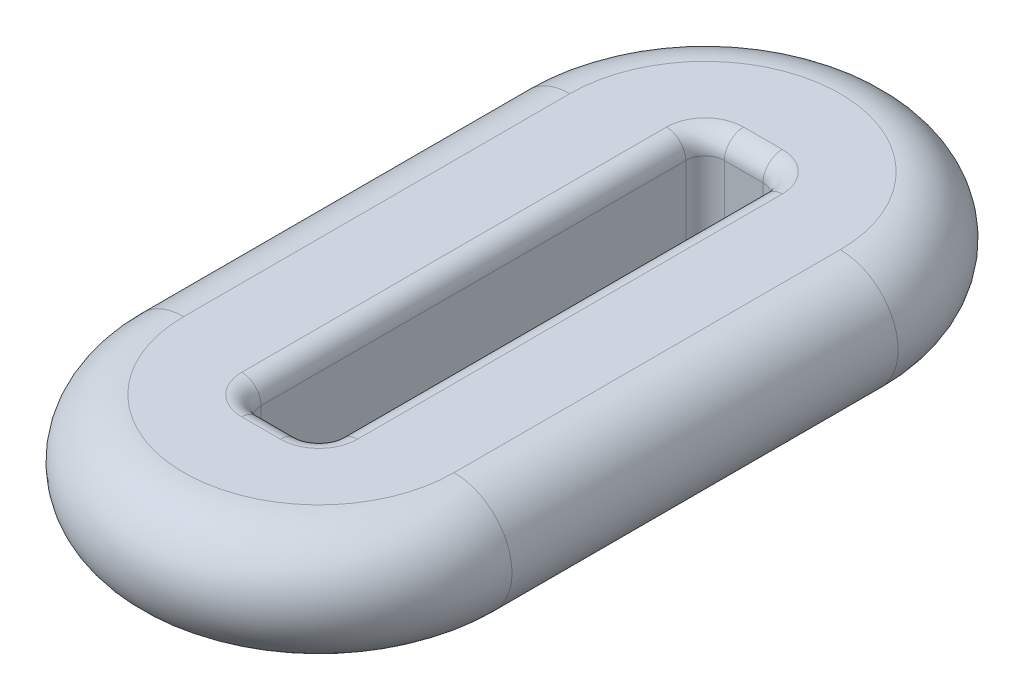
ISO-10303-21;
HEADER;
FILE_DESCRIPTION(('STEP AP214'),'2;1');
FILE_NAME('part.step','',(''),(''),'','','');
FILE_SCHEMA(('AUTOMOTIVE_DESIGN { 1 0 10303 214 1 1 1 1 }'));
ENDSEC;
DATA;
#1=APPLICATION_CONTEXT('core data for automotive mechanical design processes');
#2=APPLICATION_PROTOCOL_DEFINITION('international standard','automotive_design',2000,#1);
#3=PRODUCT_CONTEXT('',#1,'mechanical');
#4=PRODUCT('Part','Part','',(#3));
#5=PRODUCT_RELATED_PRODUCT_CATEGORY('part','',(#4));
#6=PRODUCT_DEFINITION_FORMATION('','',#4);
#7=PRODUCT_DEFINITION_CONTEXT('part definition',#1,'design');
#8=PRODUCT_DEFINITION('design','',#6,#7);
#9=PRODUCT_DEFINITION_SHAPE('','',#8);
#10=(LENGTH_UNIT() NAMED_UNIT(*) SI_UNIT(.MILLI.,.METRE.));
#11=(NAMED_UNIT(*) PLANE_ANGLE_UNIT() SI_UNIT($,.RADIAN.));
#12=(NAMED_UNIT(*) SI_UNIT($,.STERADIAN.) SOLID_ANGLE_UNIT());
#13=UNCERTAINTY_MEASURE_WITH_UNIT(LENGTH_MEASURE(1.E-05),#10,'distance_accuracy_value','');
#14=(GEOMETRIC_REPRESENTATION_CONTEXT(3) GLOBAL_UNCERTAINTY_ASSIGNED_CONTEXT((#13)) GLOBAL_UNIT_ASSIGNED_CONTEXT((#10,
#11,#12)) REPRESENTATION_CONTEXT('',''));
#15=CARTESIAN_POINT('',(0.,0.,0.));
#16=DIRECTION('',(0.,0.,1.));
#17=DIRECTION('',(1.,0.,0.));
#18=AXIS2_PLACEMENT_3D('',#15,#16,#17);
#19=CARTESIAN_POINT('',(0.,0.,5.));
#20=DIRECTION('',(0.,-1.,0.));
#21=DIRECTION('',(0.,0.,-0.999999999999999));
#22=AXIS2_PLACEMENT_3D('',#19,#20,#21);
#23=TOROIDAL_SURFACE('',#22,3.5,1.5);
#24=CARTESIAN_POINT('',(-3.49999999999998,0.,5.));
#25=DIRECTION('',(0.,0.,-0.999999999999999));
#26=DIRECTION('',(-1.,0.,0.));
#27=AXIS2_PLACEMENT_3D('',#24,#25,#26);
#28=CIRCLE('',#27,1.5);
#29=CARTESIAN_POINT('',(-3.50000000000003,-1.50000000000003,5.));
#30=VERTEX_POINT('',#29);
#31=CARTESIAN_POINT('',(-3.5,1.5,5.));
#32=VERTEX_POINT('',#31);
#33=EDGE_CURVE('E13',#30,#32,#28,.T.);
#34=ORIENTED_EDGE('',*,*,#33,.F.);
#35=CARTESIAN_POINT('',(0.,-1.5,5.));
#36=DIRECTION('',(0.,1.,0.));
#37=DIRECTION('',(0.,0.,0.999999999999999));
#38=AXIS2_PLACEMENT_3D('',#35,#36,#37);
#39=CIRCLE('',#38,3.5);
#40=CARTESIAN_POINT('',(3.5,-1.49999999999997,5.));
#41=VERTEX_POINT('',#40);
#42=EDGE_CURVE('E267',#41,#30,#39,.F.);
#43=ORIENTED_EDGE('',*,*,#42,.F.);
#44=CARTESIAN_POINT('',(3.5,0.,5.));
#45=DIRECTION('',(0.,0.,0.999999999999999));
#46=DIRECTION('',(1.,0.,0.));
#47=AXIS2_PLACEMENT_3D('',#44,#45,#46);
#48=CIRCLE('',#47,1.5);
#49=CARTESIAN_POINT('',(3.50000000000003,1.50000000000003,5.));
#50=VERTEX_POINT('',#49);
#51=EDGE_CURVE('E58',#41,#50,#48,.T.);
#52=ORIENTED_EDGE('',*,*,#51,.T.);
#53=CARTESIAN_POINT('',(0.,1.49999999999997,5.));
#54=DIRECTION('',(0.,1.,0.));
#55=DIRECTION('',(0.,0.,0.999999999999999));
#56=AXIS2_PLACEMENT_3D('',#53,#54,#55);
#57=CIRCLE('',#56,3.5);
#58=EDGE_CURVE('E319',#32,#50,#57,.T.);
#59=ORIENTED_EDGE('',*,*,#58,.F.);
#60=EDGE_LOOP('',(#34,#43,#52,#59));
#61=FACE_BOUND('',#60,.T.);
#62=ADVANCED_FACE('F51',(#61),#23,.T.);
#63=CARTESIAN_POINT('',(3.5,0.,-4.99999999999999));
#64=DIRECTION('',(0.,0.,0.999999999999999));
#65=DIRECTION('',(1.,0.,0.));
#66=AXIS2_PLACEMENT_3D('',#63,#64,#65);
#67=CYLINDRICAL_SURFACE('',#66,1.5);
#68=ORIENTED_EDGE('',*,*,#51,.F.);
#69=DIRECTION('',(0.,0.,0.999999999999999));
#70=VECTOR('',#69,1.);
#71=CARTESIAN_POINT('',(3.5,-1.49999999999997,9.99999999999998));
#72=LINE('',#71,#70);
#73=CARTESIAN_POINT('',(3.5,-1.49999999999997,-4.99999999999999));
#74=VERTEX_POINT('',#73);
#75=EDGE_CURVE('E310',#74,#41,#72,.T.);
#76=ORIENTED_EDGE('',*,*,#75,.F.);
#77=CARTESIAN_POINT('',(3.5,0.,-4.99999999999999));
#78=DIRECTION('',(0.,0.,0.999999999999999));
#79=DIRECTION('',(1.,0.,0.));
#80=AXIS2_PLACEMENT_3D('',#77,#78,#79);
#81=CIRCLE('',#80,1.5);
#82=CARTESIAN_POINT('',(3.50000000000006,1.50000000000003,-4.99999999999999));
#83=VERTEX_POINT('',#82);
#84=EDGE_CURVE('E73',#74,#83,#81,.T.);
#85=ORIENTED_EDGE('',*,*,#84,.T.);
#86=DIRECTION('',(0.,0.,-0.999999999999999));
#87=VECTOR('',#86,1.);
#88=CARTESIAN_POINT('',(3.50000000000006,1.50000000000003,-4.99999999999999));
#89=LINE('',#88,#87);
#90=EDGE_CURVE('E322',#50,#83,#89,.T.);
#91=ORIENTED_EDGE('',*,*,#90,.F.);
#92=EDGE_LOOP('',(#68,#76,#85,#91));
#93=FACE_BOUND('',#92,.T.);
#94=ADVANCED_FACE('F335',(#93),#67,.T.);
#95=CARTESIAN_POINT('',(0.,0.,-4.99999999999999));
#96=DIRECTION('',(0.,-1.,0.));
#97=DIRECTION('',(0.,0.,-0.999999999999999));
#98=AXIS2_PLACEMENT_3D('',#95,#96,#97);
#99=TOROIDAL_SURFACE('',#98,3.5,1.5);
#100=ORIENTED_EDGE('',*,*,#84,.F.);
#101=CARTESIAN_POINT('',(0.,-1.5,-4.99999999999999));
#102=DIRECTION('',(0.,1.,0.));
#103=DIRECTION('',(0.,0.,0.999999999999999));
#104=AXIS2_PLACEMENT_3D('',#101,#102,#103);
#105=CIRCLE('',#104,3.5);
#106=CARTESIAN_POINT('',(-3.50000000000003,-1.50000000000003,-5.));
#107=VERTEX_POINT('',#106);
#108=EDGE_CURVE('E313',#107,#74,#105,.F.);
#109=ORIENTED_EDGE('',*,*,#108,.F.);
#110=CARTESIAN_POINT('',(-3.49999999999998,0.,-4.99999999999999));
#111=DIRECTION('',(0.,0.,-0.999999999999999));
#112=DIRECTION('',(0.,1.,0.));
#113=AXIS2_PLACEMENT_3D('',#110,#111,#112);
#114=CIRCLE('',#113,1.5);
#115=CARTESIAN_POINT('',(-3.5,1.5,-5.));
#116=VERTEX_POINT('',#115);
#117=EDGE_CURVE('E65',#107,#116,#114,.T.);
#118=ORIENTED_EDGE('',*,*,#117,.T.);
#119=CARTESIAN_POINT('',(0.,1.49999999999997,-4.99999999999999));
#120=DIRECTION('',(0.,1.,0.));
#121=DIRECTION('',(0.,0.,0.999999999999999));
#122=AXIS2_PLACEMENT_3D('',#119,#120,#121);
#123=CIRCLE('',#122,3.5);
#124=EDGE_CURVE('E325',#83,#116,#123,.T.);
#125=ORIENTED_EDGE('',*,*,#124,.F.);
#126=EDGE_LOOP('',(#100,#109,#118,#125));
#127=FACE_BOUND('',#126,.T.);
#128=ADVANCED_FACE('F343',(#127),#99,.T.);
#129=CARTESIAN_POINT('',(-3.49999999999998,0.,5.));
#130=DIRECTION('',(0.,0.,-0.999999999999999));
#131=DIRECTION('',(-1.,0.,0.));
#132=AXIS2_PLACEMENT_3D('',#129,#130,#131);
#133=CYLINDRICAL_SURFACE('',#132,1.5);
#134=DIRECTION('',(0.,0.,-0.999999999999999));
#135=VECTOR('',#134,1.);
#136=CARTESIAN_POINT('',(-3.50000000000003,-1.50000000000003,9.99999999999998));
#137=LINE('',#136,#135);
#138=EDGE_CURVE('E316',#30,#107,#137,.T.);
#139=ORIENTED_EDGE('',*,*,#138,.F.);
#140=ORIENTED_EDGE('',*,*,#33,.T.);
#141=DIRECTION('',(0.,0.,0.999999999999999));
#142=VECTOR('',#141,1.);
#143=CARTESIAN_POINT('',(-3.5,1.5,5.));
#144=LINE('',#143,#142);
#145=EDGE_CURVE('E328',#116,#32,#144,.T.);
#146=ORIENTED_EDGE('',*,*,#145,.F.);
#147=ORIENTED_EDGE('',*,*,#117,.F.);
#148=EDGE_LOOP('',(#139,#140,#146,#147));
#149=FACE_BOUND('',#148,.T.);
#150=ADVANCED_FACE('F341',(#149),#133,.T.);
#151=CARTESIAN_POINT('',(-5.,1.49999999999997,9.99999999999998));
#152=DIRECTION('',(0.,1.,0.));
#153=DIRECTION('',(0.,0.,0.999999999999999));
#154=AXIS2_PLACEMENT_3D('',#151,#152,#153);
#155=PLANE('',#154);
#156=ORIENTED_EDGE('',*,*,#124,.T.);
#157=ORIENTED_EDGE('',*,*,#145,.T.);
#158=ORIENTED_EDGE('',*,*,#58,.T.);
#159=ORIENTED_EDGE('',*,*,#90,.T.);
#160=EDGE_LOOP('',(#156,#157,#158,#159));
#161=FACE_BOUND('',#160,.T.);
#162=DIRECTION('',(0.,0.,0.999999999999999));
#163=VECTOR('',#162,1.);
#164=CARTESIAN_POINT('',(-1.49999999999995,1.5,9.99999999999998));
#165=LINE('',#164,#163);
#166=CARTESIAN_POINT('',(-1.49999999999995,1.5,5.50000000000001));
#167=VERTEX_POINT('',#166);
#168=CARTESIAN_POINT('',(-1.49999999999995,1.5,-5.50000000000001));
#169=VERTEX_POINT('',#168);
#170=EDGE_CURVE('E247',#167,#169,#165,.F.);
#171=ORIENTED_EDGE('',*,*,#170,.T.);
#172=CARTESIAN_POINT('',(-0.499999999999945,1.49999999999997,-5.50000000000001));
#173=DIRECTION('',(0.,1.,0.));
#174=DIRECTION('',(0.,0.,0.999999999999999));
#175=AXIS2_PLACEMENT_3D('',#172,#173,#174);
#176=CIRCLE('',#175,1.);
#177=CARTESIAN_POINT('',(-0.499999999999945,1.49999999999997,-6.50000000000001));
#178=VERTEX_POINT('',#177);
#179=EDGE_CURVE('E261',#169,#178,#176,.F.);
#180=ORIENTED_EDGE('',*,*,#179,.T.);
#181=DIRECTION('',(-1.,0.,0.));
#182=VECTOR('',#181,1.);
#183=CARTESIAN_POINT('',(-5.,1.49999999999997,-6.50000000000001));
#184=LINE('',#183,#182);
#185=CARTESIAN_POINT('',(0.5,1.49999999999997,-6.50000000000001));
#186=VERTEX_POINT('',#185);
#187=EDGE_CURVE('E259',#178,#186,#184,.F.);
#188=ORIENTED_EDGE('',*,*,#187,.T.);
#189=CARTESIAN_POINT('',(0.5,1.49999999999997,-5.50000000000001));
#190=DIRECTION('',(0.,1.,0.));
#191=DIRECTION('',(0.,0.,0.999999999999999));
#192=AXIS2_PLACEMENT_3D('',#189,#190,#191);
#193=CIRCLE('',#192,1.);
#194=CARTESIAN_POINT('',(1.5,1.50000000000003,-5.50000000000001));
#195=VERTEX_POINT('',#194);
#196=EDGE_CURVE('E257',#186,#195,#193,.F.);
#197=ORIENTED_EDGE('',*,*,#196,.T.);
#198=DIRECTION('',(0.,0.,-0.999999999999999));
#199=VECTOR('',#198,1.);
#200=CARTESIAN_POINT('',(1.5,1.50000000000003,9.99999999999998));
#201=LINE('',#200,#199);
#202=CARTESIAN_POINT('',(1.5,1.50000000000003,5.50000000000001));
#203=VERTEX_POINT('',#202);
#204=EDGE_CURVE('E255',#195,#203,#201,.F.);
#205=ORIENTED_EDGE('',*,*,#204,.T.);
#206=CARTESIAN_POINT('',(0.5,1.49999999999997,5.50000000000001));
#207=DIRECTION('',(0.,1.,0.));
#208=DIRECTION('',(0.,0.,0.999999999999999));
#209=AXIS2_PLACEMENT_3D('',#206,#207,#208);
#210=CIRCLE('',#209,1.);
#211=CARTESIAN_POINT('',(0.5,1.49999999999997,6.50000000000001));
#212=VERTEX_POINT('',#211);
#213=EDGE_CURVE('E253',#203,#212,#210,.F.);
#214=ORIENTED_EDGE('',*,*,#213,.T.);
#215=DIRECTION('',(1.,0.,0.));
#216=VECTOR('',#215,1.);
#217=CARTESIAN_POINT('',(-5.,1.49999999999997,6.50000000000001));
#218=LINE('',#217,#216);
#219=CARTESIAN_POINT('',(-0.499999999999945,1.49999999999997,6.50000000000001));
#220=VERTEX_POINT('',#219);
#221=EDGE_CURVE('E251',#212,#220,#218,.F.);
#222=ORIENTED_EDGE('',*,*,#221,.T.);
#223=CARTESIAN_POINT('',(-0.499999999999945,1.49999999999997,5.50000000000001));
#224=DIRECTION('',(0.,1.,0.));
#225=DIRECTION('',(0.,0.,0.999999999999999));
#226=AXIS2_PLACEMENT_3D('',#223,#224,#225);
#227=CIRCLE('',#226,1.);
#228=EDGE_CURVE('E249',#220,#167,#227,.F.);
#229=ORIENTED_EDGE('',*,*,#228,.T.);
#230=EDGE_LOOP('',(#171,#180,#188,#197,#205,#214,#222,#229));
#231=FACE_BOUND('',#230,.T.);
#232=ADVANCED_FACE('F337',(#161,#231),#155,.T.);
#233=CARTESIAN_POINT('',(-4.99999999999998,-1.5,9.99999999999998));
#234=DIRECTION('',(0.,1.,0.));
#235=DIRECTION('',(0.,0.,0.999999999999999));
#236=AXIS2_PLACEMENT_3D('',#233,#234,#235);
#237=PLANE('',#236);
#238=ORIENTED_EDGE('',*,*,#42,.T.);
#239=ORIENTED_EDGE('',*,*,#138,.T.);
#240=ORIENTED_EDGE('',*,*,#108,.T.);
#241=ORIENTED_EDGE('',*,*,#75,.T.);
#242=EDGE_LOOP('',(#238,#239,#240,#241));
#243=FACE_BOUND('',#242,.T.);
#244=DIRECTION('',(-1.,0.,0.));
#245=VECTOR('',#244,1.);
#246=CARTESIAN_POINT('',(-0.5,-1.5,-6.50000000000001));
#247=LINE('',#246,#245);
#248=CARTESIAN_POINT('',(0.500000000000028,-1.5,-6.50000000000001));
#249=VERTEX_POINT('',#248);
#250=CARTESIAN_POINT('',(-0.5,-1.5,-6.50000000000001));
#251=VERTEX_POINT('',#250);
#252=EDGE_CURVE('E212',#249,#251,#247,.T.);
#253=ORIENTED_EDGE('',*,*,#252,.T.);
#254=CARTESIAN_POINT('',(-0.5,-1.5,-5.50000000000001));
#255=DIRECTION('',(0.,1.,0.));
#256=DIRECTION('',(0.,0.,0.999999999999999));
#257=AXIS2_PLACEMENT_3D('',#254,#255,#256);
#258=CIRCLE('',#257,1.);
#259=CARTESIAN_POINT('',(-1.50000000000006,-1.50000000000003,-5.50000000000001));
#260=VERTEX_POINT('',#259);
#261=EDGE_CURVE('E192',#251,#260,#258,.T.);
#262=ORIENTED_EDGE('',*,*,#261,.T.);
#263=DIRECTION('',(0.,0.,0.999999999999999));
#264=VECTOR('',#263,1.);
#265=CARTESIAN_POINT('',(-1.5,-1.5,5.50000000000001));
#266=LINE('',#265,#264);
#267=CARTESIAN_POINT('',(-1.5,-1.5,5.50000000000001));
#268=VERTEX_POINT('',#267);
#269=EDGE_CURVE('E201',#260,#268,#266,.T.);
#270=ORIENTED_EDGE('',*,*,#269,.T.);
#271=CARTESIAN_POINT('',(-0.5,-1.5,5.50000000000001));
#272=DIRECTION('',(0.,1.,0.));
#273=DIRECTION('',(0.,0.,0.999999999999999));
#274=AXIS2_PLACEMENT_3D('',#271,#272,#273);
#275=CIRCLE('',#274,1.);
#276=CARTESIAN_POINT('',(-0.5,-1.5,6.50000000000001));
#277=VERTEX_POINT('',#276);
#278=EDGE_CURVE('E207',#268,#277,#275,.T.);
#279=ORIENTED_EDGE('',*,*,#278,.T.);
#280=DIRECTION('',(1.,0.,0.));
#281=VECTOR('',#280,1.);
#282=CARTESIAN_POINT('',(0.500000000000028,-1.5,6.50000000000001));
#283=LINE('',#282,#281);
#284=CARTESIAN_POINT('',(0.500000000000028,-1.5,6.50000000000001));
#285=VERTEX_POINT('',#284);
#286=EDGE_CURVE('E595',#277,#285,#283,.T.);
#287=ORIENTED_EDGE('',*,*,#286,.T.);
#288=CARTESIAN_POINT('',(0.500000000000028,-1.5,5.50000000000001));
#289=DIRECTION('',(0.,1.,0.));
#290=DIRECTION('',(0.,0.,0.999999999999999));
#291=AXIS2_PLACEMENT_3D('',#288,#289,#290);
#292=CIRCLE('',#291,1.);
#293=CARTESIAN_POINT('',(1.50000000000006,-1.50000000000003,5.50000000000001));
#294=VERTEX_POINT('',#293);
#295=EDGE_CURVE('E597',#285,#294,#292,.T.);
#296=ORIENTED_EDGE('',*,*,#295,.T.);
#297=DIRECTION('',(0.,0.,-0.999999999999999));
#298=VECTOR('',#297,1.);
#299=CARTESIAN_POINT('',(1.50000000000006,-1.50000000000003,-5.50000000000001));
#300=LINE('',#299,#298);
#301=CARTESIAN_POINT('',(1.50000000000006,-1.50000000000003,-5.50000000000001));
#302=VERTEX_POINT('',#301);
#303=EDGE_CURVE('E602',#294,#302,#300,.T.);
#304=ORIENTED_EDGE('',*,*,#303,.T.);
#305=CARTESIAN_POINT('',(0.500000000000028,-1.5,-5.50000000000001));
#306=DIRECTION('',(0.,1.,0.));
#307=DIRECTION('',(0.,0.,0.999999999999999));
#308=AXIS2_PLACEMENT_3D('',#305,#306,#307);
#309=CIRCLE('',#308,1.);
#310=EDGE_CURVE('E218',#302,#249,#309,.T.);
#311=ORIENTED_EDGE('',*,*,#310,.T.);
#312=EDGE_LOOP('',(#253,#262,#270,#279,#287,#296,#304,#311));
#313=FACE_BOUND('',#312,.T.);
#314=ADVANCED_FACE('F210',(#243,#313),#237,.F.);
#315=CARTESIAN_POINT('',(-1.,1.5,-6.00000000000001));
#316=DIRECTION('',(1.,0.,0.));
#317=DIRECTION('',(0.,0.,-0.999999999999999));
#318=AXIS2_PLACEMENT_3D('',#315,#316,#317);
#319=PLANE('',#318);
#320=DIRECTION('',(0.,-1.,0.));
#321=VECTOR('',#320,1.);
#322=CARTESIAN_POINT('',(-1.,-1.50000000000003,5.50000000000001));
#323=LINE('',#322,#321);
#324=CARTESIAN_POINT('',(-1.00000000000003,0.999999999999945,5.50000000000001));
#325=VERTEX_POINT('',#324);
#326=CARTESIAN_POINT('',(-1.,-1.,5.50000000000001));
#327=VERTEX_POINT('',#326);
#328=EDGE_CURVE('E584',#325,#327,#323,.T.);
#329=ORIENTED_EDGE('',*,*,#328,.T.);
#330=DIRECTION('',(0.,0.,0.999999999999999));
#331=VECTOR('',#330,1.);
#332=CARTESIAN_POINT('',(-1.,-1.,-5.50000000000001));
#333=LINE('',#332,#331);
#334=CARTESIAN_POINT('',(-1.,-1.,-5.50000000000001));
#335=VERTEX_POINT('',#334);
#336=EDGE_CURVE('E266',#327,#335,#333,.F.);
#337=ORIENTED_EDGE('',*,*,#336,.T.);
#338=DIRECTION('',(0.,-1.,0.));
#339=VECTOR('',#338,1.);
#340=CARTESIAN_POINT('',(-1.,1.5,-5.50000000000001));
#341=LINE('',#340,#339);
#342=CARTESIAN_POINT('',(-1.00000000000003,0.999999999999945,-5.50000000000001));
#343=VERTEX_POINT('',#342);
#344=EDGE_CURVE('E589',#335,#343,#341,.F.);
#345=ORIENTED_EDGE('',*,*,#344,.T.);
#346=DIRECTION('',(0.,0.,0.999999999999999));
#347=VECTOR('',#346,1.);
#348=CARTESIAN_POINT('',(-1.00000000000003,0.999999999999945,-6.00000000000001));
#349=LINE('',#348,#347);
#350=EDGE_CURVE('E264',#343,#325,#349,.T.);
#351=ORIENTED_EDGE('',*,*,#350,.T.);
#352=EDGE_LOOP('',(#329,#337,#345,#351));
#353=FACE_BOUND('',#352,.T.);
#354=ADVANCED_FACE('F561',(#353),#319,.T.);
#355=CARTESIAN_POINT('',(-1.,1.5,6.00000000000001));
#356=DIRECTION('',(0.,0.,-0.999999999999999));
#357=DIRECTION('',(-1.,0.,0.));
#358=AXIS2_PLACEMENT_3D('',#355,#356,#357);
#359=PLANE('',#358);
#360=DIRECTION('',(0.,-1.,0.));
#361=VECTOR('',#360,1.);
#362=CARTESIAN_POINT('',(0.500000000000028,-1.5,6.00000000000001));
#363=LINE('',#362,#361);
#364=CARTESIAN_POINT('',(0.5,1.,6.00000000000001));
#365=VERTEX_POINT('',#364);
#366=CARTESIAN_POINT('',(0.499999999999973,-1.00000000000003,6.00000000000001));
#367=VERTEX_POINT('',#366);
#368=EDGE_CURVE('E208',#365,#367,#363,.T.);
#369=ORIENTED_EDGE('',*,*,#368,.T.);
#370=DIRECTION('',(1.,0.,0.));
#371=VECTOR('',#370,1.);
#372=CARTESIAN_POINT('',(-0.5,-0.999999999999973,6.00000000000001));
#373=LINE('',#372,#371);
#374=CARTESIAN_POINT('',(-0.5,-0.999999999999973,6.00000000000001));
#375=VERTEX_POINT('',#374);
#376=EDGE_CURVE('E241',#367,#375,#373,.F.);
#377=ORIENTED_EDGE('',*,*,#376,.T.);
#378=DIRECTION('',(0.,-1.,0.));
#379=VECTOR('',#378,1.);
#380=CARTESIAN_POINT('',(-0.499999999999945,1.49999999999997,6.00000000000001));
#381=LINE('',#380,#379);
#382=CARTESIAN_POINT('',(-0.500000000000028,0.999999999999973,6.00000000000001));
#383=VERTEX_POINT('',#382);
#384=EDGE_CURVE('E624',#375,#383,#381,.F.);
#385=ORIENTED_EDGE('',*,*,#384,.T.);
#386=DIRECTION('',(1.,0.,0.));
#387=VECTOR('',#386,1.);
#388=CARTESIAN_POINT('',(-1.00000000000003,0.999999999999945,6.00000000000001));
#389=LINE('',#388,#387);
#390=EDGE_CURVE('E239',#383,#365,#389,.T.);
#391=ORIENTED_EDGE('',*,*,#390,.T.);
#392=EDGE_LOOP('',(#369,#377,#385,#391));
#393=FACE_BOUND('',#392,.T.);
#394=ADVANCED_FACE('F553',(#393),#359,.T.);
#395=CARTESIAN_POINT('',(1.00000000000003,1.5,-6.00000000000001));
#396=DIRECTION('',(-1.,0.,0.));
#397=DIRECTION('',(0.,0.,0.999999999999999));
#398=AXIS2_PLACEMENT_3D('',#395,#396,#397);
#399=PLANE('',#398);
#400=DIRECTION('',(0.,-1.,0.));
#401=VECTOR('',#400,1.);
#402=CARTESIAN_POINT('',(0.999999999999973,-1.5,-5.50000000000001));
#403=LINE('',#402,#401);
#404=CARTESIAN_POINT('',(1.,1.00000000000003,-5.50000000000001));
#405=VERTEX_POINT('',#404);
#406=CARTESIAN_POINT('',(0.999999999999973,-0.999999999999973,-5.50000000000001));
#407=VERTEX_POINT('',#406);
#408=EDGE_CURVE('E616',#405,#407,#403,.T.);
#409=ORIENTED_EDGE('',*,*,#408,.T.);
#410=DIRECTION('',(0.,0.,-0.999999999999999));
#411=VECTOR('',#410,1.);
#412=CARTESIAN_POINT('',(0.999999999999973,-0.999999999999973,5.50000000000001));
#413=LINE('',#412,#411);
#414=CARTESIAN_POINT('',(0.999999999999973,-0.999999999999973,5.50000000000001));
#415=VERTEX_POINT('',#414);
#416=EDGE_CURVE('E233',#407,#415,#413,.F.);
#417=ORIENTED_EDGE('',*,*,#416,.T.);
#418=DIRECTION('',(0.,-1.,0.));
#419=VECTOR('',#418,1.);
#420=CARTESIAN_POINT('',(1.00000000000003,1.5,5.50000000000001));
#421=LINE('',#420,#419);
#422=CARTESIAN_POINT('',(1.,1.00000000000003,5.50000000000001));
#423=VERTEX_POINT('',#422);
#424=EDGE_CURVE('E286',#415,#423,#421,.F.);
#425=ORIENTED_EDGE('',*,*,#424,.T.);
#426=DIRECTION('',(0.,0.,-0.999999999999999));
#427=VECTOR('',#426,1.);
#428=CARTESIAN_POINT('',(1.,1.00000000000003,-6.00000000000001));
#429=LINE('',#428,#427);
#430=EDGE_CURVE('E231',#423,#405,#429,.T.);
#431=ORIENTED_EDGE('',*,*,#430,.T.);
#432=EDGE_LOOP('',(#409,#417,#425,#431));
#433=FACE_BOUND('',#432,.T.);
#434=ADVANCED_FACE('F545',(#433),#399,.T.);
#435=CARTESIAN_POINT('',(-1.,1.5,-6.00000000000001));
#436=DIRECTION('',(0.,0.,0.999999999999999));
#437=DIRECTION('',(1.,0.,0.));
#438=AXIS2_PLACEMENT_3D('',#435,#436,#437);
#439=PLANE('',#438);
#440=DIRECTION('',(0.,-1.,0.));
#441=VECTOR('',#440,1.);
#442=CARTESIAN_POINT('',(-0.5,-1.5,-6.00000000000001));
#443=LINE('',#442,#441);
#444=CARTESIAN_POINT('',(-0.500000000000028,0.999999999999973,-6.00000000000001));
#445=VERTEX_POINT('',#444);
#446=CARTESIAN_POINT('',(-0.5,-0.999999999999973,-6.00000000000001));
#447=VERTEX_POINT('',#446);
#448=EDGE_CURVE('E613',#445,#447,#443,.T.);
#449=ORIENTED_EDGE('',*,*,#448,.T.);
#450=DIRECTION('',(-1.,0.,0.));
#451=VECTOR('',#450,1.);
#452=CARTESIAN_POINT('',(0.499999999999973,-1.00000000000003,-6.00000000000001));
#453=LINE('',#452,#451);
#454=CARTESIAN_POINT('',(0.499999999999973,-1.00000000000003,-6.00000000000001));
#455=VERTEX_POINT('',#454);
#456=EDGE_CURVE('E225',#447,#455,#453,.F.);
#457=ORIENTED_EDGE('',*,*,#456,.T.);
#458=DIRECTION('',(0.,-1.,0.));
#459=VECTOR('',#458,1.);
#460=CARTESIAN_POINT('',(0.5,1.49999999999997,-6.00000000000001));
#461=LINE('',#460,#459);
#462=CARTESIAN_POINT('',(0.5,1.,-6.00000000000001));
#463=VERTEX_POINT('',#462);
#464=EDGE_CURVE('E590',#455,#463,#461,.F.);
#465=ORIENTED_EDGE('',*,*,#464,.T.);
#466=DIRECTION('',(-1.,0.,0.));
#467=VECTOR('',#466,1.);
#468=CARTESIAN_POINT('',(-1.00000000000003,0.999999999999945,-6.00000000000001));
#469=LINE('',#468,#467);
#470=EDGE_CURVE('E223',#463,#445,#469,.T.);
#471=ORIENTED_EDGE('',*,*,#470,.T.);
#472=EDGE_LOOP('',(#449,#457,#465,#471));
#473=FACE_BOUND('',#472,.T.);
#474=ADVANCED_FACE('F537',(#473),#439,.T.);
#475=CARTESIAN_POINT('',(0.5,1.49999999999997,-5.50000000000001));
#476=DIRECTION('',(0.,1.,0.));
#477=DIRECTION('',(0.,0.,0.999999999999999));
#478=AXIS2_PLACEMENT_3D('',#475,#476,#477);
#479=CYLINDRICAL_SURFACE('',#478,0.5);
#480=ORIENTED_EDGE('',*,*,#464,.F.);
#481=CARTESIAN_POINT('',(0.499999999999973,-1.00000000000003,-5.50000000000001));
#482=DIRECTION('',(0.,1.,0.));
#483=DIRECTION('',(0.,0.,0.999999999999999));
#484=AXIS2_PLACEMENT_3D('',#481,#482,#483);
#485=CIRCLE('',#484,0.5);
#486=EDGE_CURVE('E229',#455,#407,#485,.F.);
#487=ORIENTED_EDGE('',*,*,#486,.T.);
#488=ORIENTED_EDGE('',*,*,#408,.F.);
#489=CARTESIAN_POINT('',(0.5,1.,-5.50000000000001));
#490=DIRECTION('',(0.,1.,0.));
#491=DIRECTION('',(0.,0.,0.999999999999999));
#492=AXIS2_PLACEMENT_3D('',#489,#490,#491);
#493=CIRCLE('',#492,0.5);
#494=EDGE_CURVE('E227',#405,#463,#493,.T.);
#495=ORIENTED_EDGE('',*,*,#494,.T.);
#496=EDGE_LOOP('',(#480,#487,#488,#495));
#497=FACE_BOUND('',#496,.T.);
#498=ADVANCED_FACE('F529',(#497),#479,.F.);
#499=CARTESIAN_POINT('',(-0.499999999999945,1.49999999999997,-5.50000000000001));
#500=DIRECTION('',(0.,1.,0.));
#501=DIRECTION('',(0.,0.,0.999999999999999));
#502=AXIS2_PLACEMENT_3D('',#499,#500,#501);
#503=CYLINDRICAL_SURFACE('',#502,0.5);
#504=ORIENTED_EDGE('',*,*,#344,.F.);
#505=CARTESIAN_POINT('',(-0.5,-0.999999999999973,-5.50000000000001));
#506=DIRECTION('',(0.,1.,0.));
#507=DIRECTION('',(0.,0.,0.999999999999999));
#508=AXIS2_PLACEMENT_3D('',#505,#506,#507);
#509=CIRCLE('',#508,0.5);
#510=EDGE_CURVE('E194',#335,#447,#509,.F.);
#511=ORIENTED_EDGE('',*,*,#510,.T.);
#512=ORIENTED_EDGE('',*,*,#448,.F.);
#513=CARTESIAN_POINT('',(-0.500000000000028,0.999999999999973,-5.50000000000001));
#514=DIRECTION('',(0.,1.,0.));
#515=DIRECTION('',(0.,0.,0.999999999999999));
#516=AXIS2_PLACEMENT_3D('',#513,#514,#515);
#517=CIRCLE('',#516,0.5);
#518=EDGE_CURVE('E214',#445,#343,#517,.T.);
#519=ORIENTED_EDGE('',*,*,#518,.T.);
#520=EDGE_LOOP('',(#504,#511,#512,#519));
#521=FACE_BOUND('',#520,.T.);
#522=ADVANCED_FACE('F521',(#521),#503,.F.);
#523=CARTESIAN_POINT('',(0.5,1.49999999999997,5.50000000000001));
#524=DIRECTION('',(0.,1.,0.));
#525=DIRECTION('',(0.,0.,0.999999999999999));
#526=AXIS2_PLACEMENT_3D('',#523,#524,#525);
#527=CYLINDRICAL_SURFACE('',#526,0.5);
#528=ORIENTED_EDGE('',*,*,#424,.F.);
#529=CARTESIAN_POINT('',(0.499999999999973,-1.00000000000003,5.50000000000001));
#530=DIRECTION('',(0.,1.,0.));
#531=DIRECTION('',(0.,0.,0.999999999999999));
#532=AXIS2_PLACEMENT_3D('',#529,#530,#531);
#533=CIRCLE('',#532,0.5);
#534=EDGE_CURVE('E237',#415,#367,#533,.F.);
#535=ORIENTED_EDGE('',*,*,#534,.T.);
#536=ORIENTED_EDGE('',*,*,#368,.F.);
#537=CARTESIAN_POINT('',(0.5,1.,5.50000000000001));
#538=DIRECTION('',(0.,1.,0.));
#539=DIRECTION('',(0.,0.,0.999999999999999));
#540=AXIS2_PLACEMENT_3D('',#537,#538,#539);
#541=CIRCLE('',#540,0.5);
#542=EDGE_CURVE('E235',#365,#423,#541,.T.);
#543=ORIENTED_EDGE('',*,*,#542,.T.);
#544=EDGE_LOOP('',(#528,#535,#536,#543));
#545=FACE_BOUND('',#544,.T.);
#546=ADVANCED_FACE('F513',(#545),#527,.F.);
#547=CARTESIAN_POINT('',(-0.499999999999945,1.49999999999997,5.50000000000001));
#548=DIRECTION('',(0.,1.,0.));
#549=DIRECTION('',(0.,0.,0.999999999999999));
#550=AXIS2_PLACEMENT_3D('',#547,#548,#549);
#551=CYLINDRICAL_SURFACE('',#550,0.5);
#552=ORIENTED_EDGE('',*,*,#384,.F.);
#553=CARTESIAN_POINT('',(-0.5,-0.999999999999973,5.50000000000001));
#554=DIRECTION('',(0.,1.,0.));
#555=DIRECTION('',(0.,0.,0.999999999999999));
#556=AXIS2_PLACEMENT_3D('',#553,#554,#555);
#557=CIRCLE('',#556,0.5);
#558=EDGE_CURVE('E245',#375,#327,#557,.F.);
#559=ORIENTED_EDGE('',*,*,#558,.T.);
#560=ORIENTED_EDGE('',*,*,#328,.F.);
#561=CARTESIAN_POINT('',(-0.500000000000028,0.999999999999973,5.50000000000001));
#562=DIRECTION('',(0.,1.,0.));
#563=DIRECTION('',(0.,0.,0.999999999999999));
#564=AXIS2_PLACEMENT_3D('',#561,#562,#563);
#565=CIRCLE('',#564,0.5);
#566=EDGE_CURVE('E243',#325,#383,#565,.T.);
#567=ORIENTED_EDGE('',*,*,#566,.T.);
#568=EDGE_LOOP('',(#552,#559,#560,#567));
#569=FACE_BOUND('',#568,.T.);
#570=ADVANCED_FACE('F504',(#569),#551,.F.);
#571=CARTESIAN_POINT('',(0.499999999999973,-1.00000000000003,5.50000000000001));
#572=DIRECTION('',(0.,1.,0.));
#573=DIRECTION('',(0.,0.,0.999999999999999));
#574=AXIS2_PLACEMENT_3D('',#571,#572,#573);
#575=TOROIDAL_SURFACE('',#574,1.,0.5);
#576=CARTESIAN_POINT('',(0.499999999999973,-1.00000000000003,6.50000000000001));
#577=DIRECTION('',(-1.,0.,0.));
#578=DIRECTION('',(0.,0.,0.999999999999999));
#579=AXIS2_PLACEMENT_3D('',#576,#577,#578);
#580=CIRCLE('',#579,0.5);
#581=EDGE_CURVE('E280',#367,#285,#580,.T.);
#582=ORIENTED_EDGE('',*,*,#581,.F.);
#583=ORIENTED_EDGE('',*,*,#534,.F.);
#584=CARTESIAN_POINT('',(1.49999999999995,-1.00000000000003,5.50000000000001));
#585=DIRECTION('',(0.,0.,-0.999999999999999));
#586=DIRECTION('',(-1.,0.,0.));
#587=AXIS2_PLACEMENT_3D('',#584,#585,#586);
#588=CIRCLE('',#587,0.5);
#589=EDGE_CURVE('E283',#294,#415,#588,.T.);
#590=ORIENTED_EDGE('',*,*,#589,.F.);
#591=ORIENTED_EDGE('',*,*,#295,.F.);
#592=EDGE_LOOP('',(#582,#583,#590,#591));
#593=FACE_BOUND('',#592,.T.);
#594=ADVANCED_FACE('F496',(#593),#575,.T.);
#595=CARTESIAN_POINT('',(1.49999999999995,-1.00000000000003,9.99999999999998));
#596=DIRECTION('',(0.,0.,0.999999999999999));
#597=DIRECTION('',(1.,0.,0.));
#598=AXIS2_PLACEMENT_3D('',#595,#596,#597);
#599=CYLINDRICAL_SURFACE('',#598,0.5);
#600=ORIENTED_EDGE('',*,*,#589,.T.);
#601=ORIENTED_EDGE('',*,*,#416,.F.);
#602=CARTESIAN_POINT('',(1.49999999999995,-1.00000000000003,-5.50000000000001));
#603=DIRECTION('',(0.,0.,-0.999999999999999));
#604=DIRECTION('',(-1.,0.,0.));
#605=AXIS2_PLACEMENT_3D('',#602,#603,#604);
#606=CIRCLE('',#605,0.5);
#607=EDGE_CURVE('E277',#302,#407,#606,.T.);
#608=ORIENTED_EDGE('',*,*,#607,.F.);
#609=ORIENTED_EDGE('',*,*,#303,.F.);
#610=EDGE_LOOP('',(#600,#601,#608,#609));
#611=FACE_BOUND('',#610,.T.);
#612=ADVANCED_FACE('F488',(#611),#599,.T.);
#613=CARTESIAN_POINT('',(-5.,-1.,6.50000000000001));
#614=DIRECTION('',(-1.,0.,0.));
#615=DIRECTION('',(0.,0.,0.999999999999999));
#616=AXIS2_PLACEMENT_3D('',#613,#614,#615);
#617=CYLINDRICAL_SURFACE('',#616,0.5);
#618=ORIENTED_EDGE('',*,*,#581,.T.);
#619=ORIENTED_EDGE('',*,*,#286,.F.);
#620=CARTESIAN_POINT('',(-0.5,-0.999999999999973,6.50000000000001));
#621=DIRECTION('',(-1.,0.,0.));
#622=DIRECTION('',(0.,0.,0.999999999999999));
#623=AXIS2_PLACEMENT_3D('',#620,#621,#622);
#624=CIRCLE('',#623,0.5);
#625=EDGE_CURVE('E274',#375,#277,#624,.T.);
#626=ORIENTED_EDGE('',*,*,#625,.F.);
#627=ORIENTED_EDGE('',*,*,#376,.F.);
#628=EDGE_LOOP('',(#618,#619,#626,#627));
#629=FACE_BOUND('',#628,.T.);
#630=ADVANCED_FACE('F479',(#629),#617,.T.);
#631=CARTESIAN_POINT('',(0.499999999999973,-1.00000000000003,-5.50000000000001));
#632=DIRECTION('',(0.,1.,0.));
#633=DIRECTION('',(0.,0.,0.999999999999999));
#634=AXIS2_PLACEMENT_3D('',#631,#632,#633);
#635=TOROIDAL_SURFACE('',#634,1.,0.5);
#636=ORIENTED_EDGE('',*,*,#607,.T.);
#637=ORIENTED_EDGE('',*,*,#486,.F.);
#638=CARTESIAN_POINT('',(0.499999999999973,-1.00000000000003,-6.50000000000001));
#639=DIRECTION('',(-1.,0.,0.));
#640=DIRECTION('',(0.,0.,0.999999999999999));
#641=AXIS2_PLACEMENT_3D('',#638,#639,#640);
#642=CIRCLE('',#641,0.5);
#643=EDGE_CURVE('E271',#249,#455,#642,.T.);
#644=ORIENTED_EDGE('',*,*,#643,.F.);
#645=ORIENTED_EDGE('',*,*,#310,.F.);
#646=EDGE_LOOP('',(#636,#637,#644,#645));
#647=FACE_BOUND('',#646,.T.);
#648=ADVANCED_FACE('F469',(#647),#635,.T.);
#649=CARTESIAN_POINT('',(-0.5,-0.999999999999973,5.50000000000001));
#650=DIRECTION('',(0.,1.,0.));
#651=DIRECTION('',(0.,0.,0.999999999999999));
#652=AXIS2_PLACEMENT_3D('',#649,#650,#651);
#653=TOROIDAL_SURFACE('',#652,1.,0.5);
#654=ORIENTED_EDGE('',*,*,#625,.T.);
#655=ORIENTED_EDGE('',*,*,#278,.F.);
#656=CARTESIAN_POINT('',(-1.49999999999997,-1.00000000000003,5.50000000000001));
#657=DIRECTION('',(0.,0.,-0.999999999999999));
#658=DIRECTION('',(-1.,0.,0.));
#659=AXIS2_PLACEMENT_3D('',#656,#657,#658);
#660=CIRCLE('',#659,0.5);
#661=EDGE_CURVE('E204',#327,#268,#660,.T.);
#662=ORIENTED_EDGE('',*,*,#661,.F.);
#663=ORIENTED_EDGE('',*,*,#558,.F.);
#664=EDGE_LOOP('',(#654,#655,#662,#663));
#665=FACE_BOUND('',#664,.T.);
#666=ADVANCED_FACE('F461',(#665),#653,.T.);
#667=CARTESIAN_POINT('',(-5.,-1.,-6.50000000000001));
#668=DIRECTION('',(1.,0.,0.));
#669=DIRECTION('',(0.,0.,-0.999999999999999));
#670=AXIS2_PLACEMENT_3D('',#667,#668,#669);
#671=CYLINDRICAL_SURFACE('',#670,0.5);
#672=ORIENTED_EDGE('',*,*,#643,.T.);
#673=ORIENTED_EDGE('',*,*,#456,.F.);
#674=CARTESIAN_POINT('',(-0.5,-0.999999999999973,-6.50000000000001));
#675=DIRECTION('',(-1.,0.,0.));
#676=DIRECTION('',(0.,0.,0.999999999999999));
#677=AXIS2_PLACEMENT_3D('',#674,#675,#676);
#678=CIRCLE('',#677,0.5);
#679=EDGE_CURVE('E197',#251,#447,#678,.T.);
#680=ORIENTED_EDGE('',*,*,#679,.F.);
#681=ORIENTED_EDGE('',*,*,#252,.F.);
#682=EDGE_LOOP('',(#672,#673,#680,#681));
#683=FACE_BOUND('',#682,.T.);
#684=ADVANCED_FACE('F454',(#683),#671,.T.);
#685=CARTESIAN_POINT('',(-1.49999999999997,-1.,9.99999999999998));
#686=DIRECTION('',(0.,0.,-0.999999999999999));
#687=DIRECTION('',(-1.,0.,0.));
#688=AXIS2_PLACEMENT_3D('',#685,#686,#687);
#689=CYLINDRICAL_SURFACE('',#688,0.5);
#690=ORIENTED_EDGE('',*,*,#661,.T.);
#691=ORIENTED_EDGE('',*,*,#269,.F.);
#692=CARTESIAN_POINT('',(-1.49999999999997,-1.00000000000003,-5.50000000000001));
#693=DIRECTION('',(0.,0.,-0.999999999999999));
#694=DIRECTION('',(-1.,0.,0.));
#695=AXIS2_PLACEMENT_3D('',#692,#693,#694);
#696=CIRCLE('',#695,0.5);
#697=EDGE_CURVE('E188',#335,#260,#696,.T.);
#698=ORIENTED_EDGE('',*,*,#697,.F.);
#699=ORIENTED_EDGE('',*,*,#336,.F.);
#700=EDGE_LOOP('',(#690,#691,#698,#699));
#701=FACE_BOUND('',#700,.T.);
#702=ADVANCED_FACE('F202',(#701),#689,.T.);
#703=CARTESIAN_POINT('',(-0.5,-0.999999999999973,-5.50000000000001));
#704=DIRECTION('',(0.,1.,0.));
#705=DIRECTION('',(0.,0.,0.999999999999999));
#706=AXIS2_PLACEMENT_3D('',#703,#704,#705);
#707=TOROIDAL_SURFACE('',#706,1.,0.5);
#708=ORIENTED_EDGE('',*,*,#679,.T.);
#709=ORIENTED_EDGE('',*,*,#510,.F.);
#710=ORIENTED_EDGE('',*,*,#697,.T.);
#711=ORIENTED_EDGE('',*,*,#261,.F.);
#712=EDGE_LOOP('',(#708,#709,#710,#711));
#713=FACE_BOUND('',#712,.T.);
#714=ADVANCED_FACE('F190',(#713),#707,.T.);
#715=CARTESIAN_POINT('',(0.5,1.,5.50000000000001));
#716=DIRECTION('',(0.,1.,0.));
#717=DIRECTION('',(0.,0.,0.999999999999999));
#718=AXIS2_PLACEMENT_3D('',#715,#716,#717);
#719=TOROIDAL_SURFACE('',#718,1.,0.5);
#720=CARTESIAN_POINT('',(1.49999999999997,1.,5.50000000000001));
#721=DIRECTION('',(0.,0.,-0.999999999999999));
#722=DIRECTION('',(-1.,0.,0.));
#723=AXIS2_PLACEMENT_3D('',#720,#721,#722);
#724=CIRCLE('',#723,0.5);
#725=EDGE_CURVE('E303',#423,#203,#724,.T.);
#726=ORIENTED_EDGE('',*,*,#725,.F.);
#727=ORIENTED_EDGE('',*,*,#542,.F.);
#728=CARTESIAN_POINT('',(0.5,1.,6.50000000000001));
#729=DIRECTION('',(-1.,0.,0.));
#730=DIRECTION('',(0.,0.,0.999999999999999));
#731=AXIS2_PLACEMENT_3D('',#728,#729,#730);
#732=CIRCLE('',#731,0.5);
#733=EDGE_CURVE('E198',#212,#365,#732,.T.);
#734=ORIENTED_EDGE('',*,*,#733,.F.);
#735=ORIENTED_EDGE('',*,*,#213,.F.);
#736=EDGE_LOOP('',(#726,#727,#734,#735));
#737=FACE_BOUND('',#736,.T.);
#738=ADVANCED_FACE('F429',(#737),#719,.T.);
#739=CARTESIAN_POINT('',(-1.00000000000003,0.999999999999945,6.50000000000001));
#740=DIRECTION('',(1.,0.,0.));
#741=DIRECTION('',(0.,0.,-0.999999999999999));
#742=AXIS2_PLACEMENT_3D('',#739,#740,#741);
#743=CYLINDRICAL_SURFACE('',#742,0.5);
#744=ORIENTED_EDGE('',*,*,#733,.T.);
#745=ORIENTED_EDGE('',*,*,#390,.F.);
#746=CARTESIAN_POINT('',(-0.500000000000028,0.999999999999973,6.50000000000001));
#747=DIRECTION('',(-1.,0.,0.));
#748=DIRECTION('',(0.,0.,0.999999999999999));
#749=AXIS2_PLACEMENT_3D('',#746,#747,#748);
#750=CIRCLE('',#749,0.5);
#751=EDGE_CURVE('E300',#220,#383,#750,.T.);
#752=ORIENTED_EDGE('',*,*,#751,.F.);
#753=ORIENTED_EDGE('',*,*,#221,.F.);
#754=EDGE_LOOP('',(#744,#745,#752,#753));
#755=FACE_BOUND('',#754,.T.);
#756=ADVANCED_FACE('F421',(#755),#743,.T.);
#757=CARTESIAN_POINT('',(1.49999999999997,1.,-6.00000000000001));
#758=DIRECTION('',(0.,0.,-0.999999999999999));
#759=DIRECTION('',(-1.,0.,0.));
#760=AXIS2_PLACEMENT_3D('',#757,#758,#759);
#761=CYLINDRICAL_SURFACE('',#760,0.5);
#762=ORIENTED_EDGE('',*,*,#725,.T.);
#763=ORIENTED_EDGE('',*,*,#204,.F.);
#764=CARTESIAN_POINT('',(1.49999999999997,1.,-5.50000000000001));
#765=DIRECTION('',(0.,0.,-0.999999999999999));
#766=DIRECTION('',(-1.,0.,0.));
#767=AXIS2_PLACEMENT_3D('',#764,#765,#766);
#768=CIRCLE('',#767,0.5);
#769=EDGE_CURVE('E297',#405,#195,#768,.T.);
#770=ORIENTED_EDGE('',*,*,#769,.F.);
#771=ORIENTED_EDGE('',*,*,#430,.F.);
#772=EDGE_LOOP('',(#762,#763,#770,#771));
#773=FACE_BOUND('',#772,.T.);
#774=ADVANCED_FACE('F412',(#773),#761,.T.);
#775=CARTESIAN_POINT('',(-0.500000000000028,0.999999999999973,5.50000000000001));
#776=DIRECTION('',(0.,1.,0.));
#777=DIRECTION('',(0.,0.,0.999999999999999));
#778=AXIS2_PLACEMENT_3D('',#775,#776,#777);
#779=TOROIDAL_SURFACE('',#778,1.,0.5);
#780=ORIENTED_EDGE('',*,*,#751,.T.);
#781=ORIENTED_EDGE('',*,*,#566,.F.);
#782=CARTESIAN_POINT('',(-1.49999999999997,0.999999999999973,5.50000000000001));
#783=DIRECTION('',(0.,0.,-0.999999999999999));
#784=DIRECTION('',(-1.,0.,0.));
#785=AXIS2_PLACEMENT_3D('',#782,#783,#784);
#786=CIRCLE('',#785,0.5);
#787=EDGE_CURVE('E294',#167,#325,#786,.T.);
#788=ORIENTED_EDGE('',*,*,#787,.F.);
#789=ORIENTED_EDGE('',*,*,#228,.F.);
#790=EDGE_LOOP('',(#780,#781,#788,#789));
#791=FACE_BOUND('',#790,.T.);
#792=ADVANCED_FACE('F401',(#791),#779,.T.);
#793=CARTESIAN_POINT('',(0.5,1.,-5.50000000000001));
#794=DIRECTION('',(0.,1.,0.));
#795=DIRECTION('',(0.,0.,0.999999999999999));
#796=AXIS2_PLACEMENT_3D('',#793,#794,#795);
#797=TOROIDAL_SURFACE('',#796,1.,0.5);
#798=ORIENTED_EDGE('',*,*,#769,.T.);
#799=ORIENTED_EDGE('',*,*,#196,.F.);
#800=CARTESIAN_POINT('',(0.5,1.,-6.50000000000001));
#801=DIRECTION('',(-1.,0.,0.));
#802=DIRECTION('',(0.,0.,0.999999999999999));
#803=AXIS2_PLACEMENT_3D('',#800,#801,#802);
#804=CIRCLE('',#803,0.5);
#805=EDGE_CURVE('E291',#463,#186,#804,.T.);
#806=ORIENTED_EDGE('',*,*,#805,.F.);
#807=ORIENTED_EDGE('',*,*,#494,.F.);
#808=EDGE_LOOP('',(#798,#799,#806,#807));
#809=FACE_BOUND('',#808,.T.);
#810=ADVANCED_FACE('F393',(#809),#797,.T.);
#811=CARTESIAN_POINT('',(-1.49999999999997,0.999999999999973,-6.00000000000001));
#812=DIRECTION('',(0.,0.,0.999999999999999));
#813=DIRECTION('',(1.,0.,0.));
#814=AXIS2_PLACEMENT_3D('',#811,#812,#813);
#815=CYLINDRICAL_SURFACE('',#814,0.5);
#816=ORIENTED_EDGE('',*,*,#787,.T.);
#817=ORIENTED_EDGE('',*,*,#350,.F.);
#818=CARTESIAN_POINT('',(-1.49999999999997,0.999999999999973,-5.50000000000001));
#819=DIRECTION('',(0.,0.,-0.999999999999999));
#820=DIRECTION('',(-1.,0.,0.));
#821=AXIS2_PLACEMENT_3D('',#818,#819,#820);
#822=CIRCLE('',#821,0.5);
#823=EDGE_CURVE('E289',#169,#343,#822,.T.);
#824=ORIENTED_EDGE('',*,*,#823,.F.);
#825=ORIENTED_EDGE('',*,*,#170,.F.);
#826=EDGE_LOOP('',(#816,#817,#824,#825));
#827=FACE_BOUND('',#826,.T.);
#828=ADVANCED_FACE('F385',(#827),#815,.T.);
#829=CARTESIAN_POINT('',(-1.00000000000003,0.999999999999945,-6.50000000000001));
#830=DIRECTION('',(-1.,0.,0.));
#831=DIRECTION('',(0.,0.,0.999999999999999));
#832=AXIS2_PLACEMENT_3D('',#829,#830,#831);
#833=CYLINDRICAL_SURFACE('',#832,0.5);
#834=ORIENTED_EDGE('',*,*,#805,.T.);
#835=ORIENTED_EDGE('',*,*,#187,.F.);
#836=CARTESIAN_POINT('',(-0.500000000000028,0.999999999999973,-6.50000000000001));
#837=DIRECTION('',(-1.,0.,0.));
#838=DIRECTION('',(0.,0.,0.999999999999999));
#839=AXIS2_PLACEMENT_3D('',#836,#837,#838);
#840=CIRCLE('',#839,0.5);
#841=EDGE_CURVE('E287',#445,#178,#840,.T.);
#842=ORIENTED_EDGE('',*,*,#841,.F.);
#843=ORIENTED_EDGE('',*,*,#470,.F.);
#844=EDGE_LOOP('',(#834,#835,#842,#843));
#845=FACE_BOUND('',#844,.T.);
#846=ADVANCED_FACE('F374',(#845),#833,.T.);
#847=CARTESIAN_POINT('',(-0.500000000000028,0.999999999999973,-5.50000000000001));
#848=DIRECTION('',(0.,1.,0.));
#849=DIRECTION('',(0.,0.,0.999999999999999));
#850=AXIS2_PLACEMENT_3D('',#847,#848,#849);
#851=TOROIDAL_SURFACE('',#850,1.,0.5);
#852=ORIENTED_EDGE('',*,*,#823,.T.);
#853=ORIENTED_EDGE('',*,*,#518,.F.);
#854=ORIENTED_EDGE('',*,*,#841,.T.);
#855=ORIENTED_EDGE('',*,*,#179,.F.);
#856=EDGE_LOOP('',(#852,#853,#854,#855));
#857=FACE_BOUND('',#856,.T.);
#858=ADVANCED_FACE('F368',(#857),#851,.T.);
#859=CLOSED_SHELL('',(#62,#94,#128,#150,#232,#314,#354,#394,#434,#474,#498,#522,#546,#570,#594,
#612,#630,#648,#666,#684,#702,#714,#738,#756,#774,#792,#810,#828,#846,#858));
#860=MANIFOLD_SOLID_BREP('B2',#859);
#861=ADVANCED_BREP_SHAPE_REPRESENTATION('',(#18,#860),#14);
#862=SHAPE_DEFINITION_REPRESENTATION(#9,#861);
ENDSEC;
END-ISO-10303-21;
